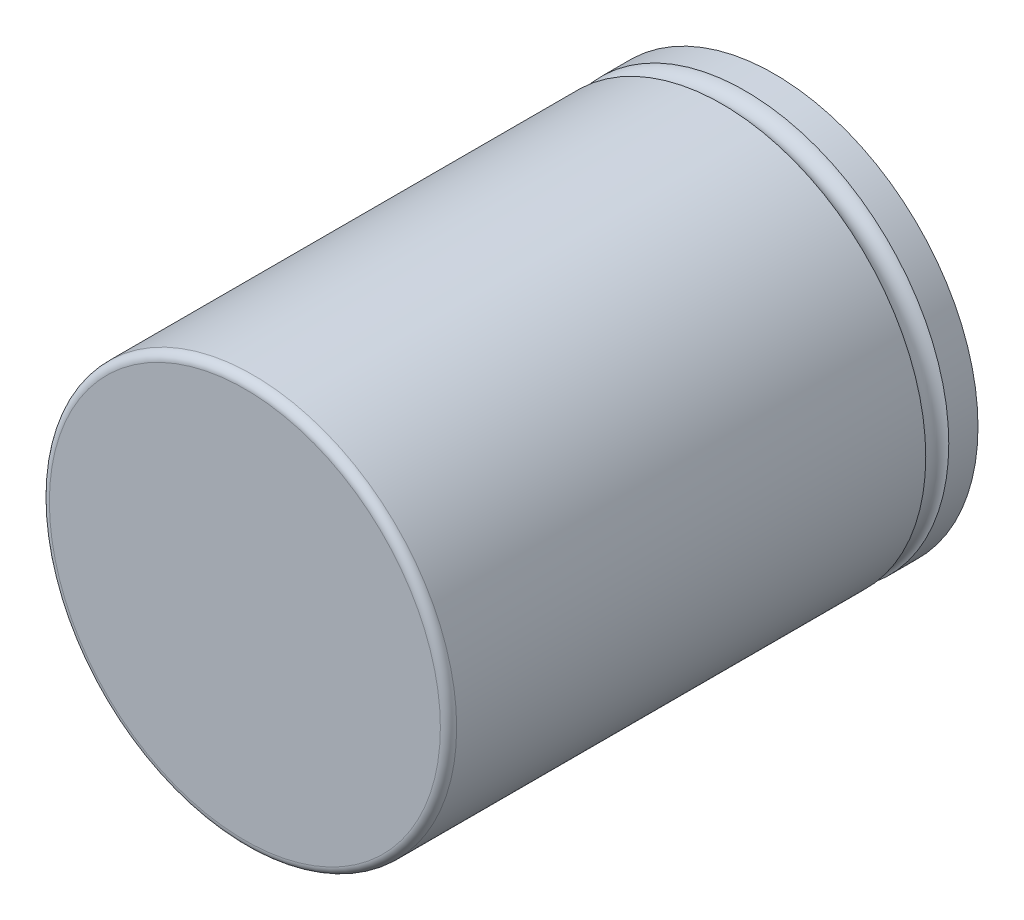
ISO-10303-21;
HEADER;
FILE_DESCRIPTION(('STEP AP214'),'2;1');
FILE_NAME('part.step','',(''),(''),'','','');
FILE_SCHEMA(('AUTOMOTIVE_DESIGN { 1 0 10303 214 1 1 1 1 }'));
ENDSEC;
DATA;
#1=APPLICATION_CONTEXT('core data for automotive mechanical design processes');
#2=APPLICATION_PROTOCOL_DEFINITION('international standard','automotive_design',2000,#1);
#3=PRODUCT_CONTEXT('',#1,'mechanical');
#4=PRODUCT('Part','Part','',(#3));
#5=PRODUCT_RELATED_PRODUCT_CATEGORY('part','',(#4));
#6=PRODUCT_DEFINITION_FORMATION('','',#4);
#7=PRODUCT_DEFINITION_CONTEXT('part definition',#1,'design');
#8=PRODUCT_DEFINITION('design','',#6,#7);
#9=PRODUCT_DEFINITION_SHAPE('','',#8);
#10=(LENGTH_UNIT() NAMED_UNIT(*) SI_UNIT(.MILLI.,.METRE.));
#11=(NAMED_UNIT(*) PLANE_ANGLE_UNIT() SI_UNIT($,.RADIAN.));
#12=(NAMED_UNIT(*) SI_UNIT($,.STERADIAN.) SOLID_ANGLE_UNIT());
#13=UNCERTAINTY_MEASURE_WITH_UNIT(LENGTH_MEASURE(1.E-05),#10,'distance_accuracy_value','');
#14=(GEOMETRIC_REPRESENTATION_CONTEXT(3) GLOBAL_UNCERTAINTY_ASSIGNED_CONTEXT((#13)) GLOBAL_UNIT_ASSIGNED_CONTEXT((#10,
#11,#12)) REPRESENTATION_CONTEXT('',''));
#15=CARTESIAN_POINT('',(0.,0.,0.));
#16=DIRECTION('',(0.,0.,1.));
#17=DIRECTION('',(1.,0.,0.));
#18=AXIS2_PLACEMENT_3D('',#15,#16,#17);
#19=CARTESIAN_POINT('',(0.,2.5,1.));
#20=DIRECTION('',(0.,0.,1.));
#21=DIRECTION('',(1.,0.,0.));
#22=AXIS2_PLACEMENT_3D('',#19,#20,#21);
#23=PLANE('',#22);
#24=CARTESIAN_POINT('',(0.,2.5,1.));
#25=DIRECTION('',(0.,0.,-1.));
#26=DIRECTION('',(-1.,0.,0.));
#27=AXIS2_PLACEMENT_3D('',#24,#25,#26);
#28=CIRCLE('',#27,0.3);
#29=CARTESIAN_POINT('',(-0.3,2.5,1.));
#30=VERTEX_POINT('',#29);
#31=EDGE_CURVE('E18',#30,#30,#28,.T.);
#32=ORIENTED_EDGE('',*,*,#31,.T.);
#33=EDGE_LOOP('',(#32));
#34=FACE_BOUND('',#33,.T.);
#35=ADVANCED_FACE('F15',(#34),#23,.F.);
#36=CARTESIAN_POINT('',(0.,-2.5,1.));
#37=DIRECTION('',(0.,0.,1.));
#38=DIRECTION('',(1.,0.,0.));
#39=AXIS2_PLACEMENT_3D('',#36,#37,#38);
#40=PLANE('',#39);
#41=CARTESIAN_POINT('',(0.,-2.5,1.));
#42=DIRECTION('',(0.,0.,-1.));
#43=DIRECTION('',(-1.,0.,0.));
#44=AXIS2_PLACEMENT_3D('',#41,#42,#43);
#45=CIRCLE('',#44,0.3);
#46=CARTESIAN_POINT('',(-0.3,-2.5,1.));
#47=VERTEX_POINT('',#46);
#48=EDGE_CURVE('E67',#47,#47,#45,.T.);
#49=ORIENTED_EDGE('',*,*,#48,.T.);
#50=EDGE_LOOP('',(#49));
#51=FACE_BOUND('',#50,.T.);
#52=ADVANCED_FACE('F79',(#51),#40,.F.);
#53=CARTESIAN_POINT('',(0.,2.5,0.));
#54=DIRECTION('',(0.,0.,-1.));
#55=DIRECTION('',(-1.,0.,0.));
#56=AXIS2_PLACEMENT_3D('',#53,#54,#55);
#57=CYLINDRICAL_SURFACE('',#56,0.3);
#58=ORIENTED_EDGE('',*,*,#31,.F.);
#59=EDGE_LOOP('',(#58));
#60=FACE_BOUND('',#59,.T.);
#61=CARTESIAN_POINT('',(0.,2.5,0.));
#62=DIRECTION('',(0.,0.,-1.));
#63=DIRECTION('',(-1.,0.,0.));
#64=AXIS2_PLACEMENT_3D('',#61,#62,#63);
#65=CIRCLE('',#64,0.3);
#66=CARTESIAN_POINT('',(-0.3,2.5,0.));
#67=VERTEX_POINT('',#66);
#68=EDGE_CURVE('E65',#67,#67,#65,.F.);
#69=ORIENTED_EDGE('',*,*,#68,.F.);
#70=EDGE_LOOP('',(#69));
#71=FACE_BOUND('',#70,.T.);
#72=ADVANCED_FACE('F75',(#60,#71),#57,.F.);
#73=CARTESIAN_POINT('',(0.,-2.5,0.));
#74=DIRECTION('',(0.,0.,-1.));
#75=DIRECTION('',(-1.,0.,0.));
#76=AXIS2_PLACEMENT_3D('',#73,#74,#75);
#77=CYLINDRICAL_SURFACE('',#76,0.3);
#78=ORIENTED_EDGE('',*,*,#48,.F.);
#79=EDGE_LOOP('',(#78));
#80=FACE_BOUND('',#79,.T.);
#81=CARTESIAN_POINT('',(0.,-2.5,0.));
#82=DIRECTION('',(0.,0.,-1.));
#83=DIRECTION('',(-1.,0.,0.));
#84=AXIS2_PLACEMENT_3D('',#81,#82,#83);
#85=CIRCLE('',#84,0.3);
#86=CARTESIAN_POINT('',(-0.3,-2.5,0.));
#87=VERTEX_POINT('',#86);
#88=EDGE_CURVE('E62',#87,#87,#85,.F.);
#89=ORIENTED_EDGE('',*,*,#88,.F.);
#90=EDGE_LOOP('',(#89));
#91=FACE_BOUND('',#90,.T.);
#92=ADVANCED_FACE('F78',(#80,#91),#77,.F.);
#93=CARTESIAN_POINT('',(0.,0.,0.));
#94=DIRECTION('',(0.,0.,-1.));
#95=DIRECTION('',(-1.,0.,0.));
#96=AXIS2_PLACEMENT_3D('',#93,#94,#95);
#97=PLANE('',#96);
#98=ORIENTED_EDGE('',*,*,#88,.T.);
#99=EDGE_LOOP('',(#98));
#100=FACE_BOUND('',#99,.T.);
#101=ORIENTED_EDGE('',*,*,#68,.T.);
#102=EDGE_LOOP('',(#101));
#103=FACE_BOUND('',#102,.T.);
#104=CARTESIAN_POINT('',(0.,0.,0.));
#105=DIRECTION('',(0.,0.,-1.));
#106=DIRECTION('',(-1.,0.,0.));
#107=AXIS2_PLACEMENT_3D('',#104,#105,#106);
#108=CIRCLE('',#107,5.);
#109=CARTESIAN_POINT('',(-5.,0.,0.));
#110=VERTEX_POINT('',#109);
#111=EDGE_CURVE('E59',#110,#110,#108,.F.);
#112=ORIENTED_EDGE('',*,*,#111,.F.);
#113=EDGE_LOOP('',(#112));
#114=FACE_BOUND('',#113,.T.);
#115=ADVANCED_FACE('F83',(#100,#103,#114),#97,.T.);
#116=CARTESIAN_POINT('',(0.,0.,0.));
#117=DIRECTION('',(0.,0.,-1.));
#118=DIRECTION('',(-1.,0.,0.));
#119=AXIS2_PLACEMENT_3D('',#116,#117,#118);
#120=CYLINDRICAL_SURFACE('',#119,5.);
#121=ORIENTED_EDGE('',*,*,#111,.T.);
#122=EDGE_LOOP('',(#121));
#123=FACE_BOUND('',#122,.T.);
#124=CARTESIAN_POINT('',(0.,0.,0.717157287525381));
#125=DIRECTION('',(0.,0.,-1.));
#126=DIRECTION('',(-1.,0.,0.));
#127=AXIS2_PLACEMENT_3D('',#124,#125,#126);
#128=CIRCLE('',#127,5.);
#129=CARTESIAN_POINT('',(-5.,0.,0.717157287525381));
#130=VERTEX_POINT('',#129);
#131=EDGE_CURVE('E51',#130,#130,#128,.T.);
#132=ORIENTED_EDGE('',*,*,#131,.T.);
#133=EDGE_LOOP('',(#132));
#134=FACE_BOUND('',#133,.T.);
#135=ADVANCED_FACE('F86',(#123,#134),#120,.T.);
#136=CARTESIAN_POINT('',(0.,0.,13.));
#137=DIRECTION('',(0.,0.,-1.));
#138=DIRECTION('',(-1.,0.,0.));
#139=AXIS2_PLACEMENT_3D('',#136,#137,#138);
#140=PLANE('',#139);
#141=CARTESIAN_POINT('',(0.,0.,13.));
#142=DIRECTION('',(0.,0.,-1.));
#143=DIRECTION('',(1.,0.,0.));
#144=AXIS2_PLACEMENT_3D('',#141,#142,#143);
#145=CIRCLE('',#144,4.8);
#146=CARTESIAN_POINT('',(4.8,0.,13.));
#147=VERTEX_POINT('',#146);
#148=EDGE_CURVE('E27',#147,#147,#145,.T.);
#149=ORIENTED_EDGE('',*,*,#148,.F.);
#150=EDGE_LOOP('',(#149));
#151=FACE_BOUND('',#150,.T.);
#152=ADVANCED_FACE('F93',(#151),#140,.F.);
#153=CARTESIAN_POINT('',(0.,0.,1.));
#154=DIRECTION('',(0.,0.,-1.));
#155=DIRECTION('',(-1.,0.,0.));
#156=AXIS2_PLACEMENT_3D('',#153,#154,#155);
#157=TOROIDAL_SURFACE('',#156,5.1,0.3);
#158=CARTESIAN_POINT('',(0.,0.,1.28284271247462));
#159=DIRECTION('',(0.,0.,-1.));
#160=DIRECTION('',(-1.,0.,0.));
#161=AXIS2_PLACEMENT_3D('',#158,#159,#160);
#162=CIRCLE('',#161,5.);
#163=CARTESIAN_POINT('',(-5.,0.,1.28284271247462));
#164=VERTEX_POINT('',#163);
#165=EDGE_CURVE('E22',#164,#164,#162,.F.);
#166=ORIENTED_EDGE('',*,*,#165,.F.);
#167=EDGE_LOOP('',(#166));
#168=FACE_BOUND('',#167,.T.);
#169=ORIENTED_EDGE('',*,*,#131,.F.);
#170=EDGE_LOOP('',(#169));
#171=FACE_BOUND('',#170,.T.);
#172=ADVANCED_FACE('F41',(#168,#171),#157,.F.);
#173=CARTESIAN_POINT('',(0.,0.,12.8));
#174=DIRECTION('',(0.,0.,-1.));
#175=DIRECTION('',(-1.,0.,0.));
#176=AXIS2_PLACEMENT_3D('',#173,#174,#175);
#177=TOROIDAL_SURFACE('',#176,4.8,0.2);
#178=CARTESIAN_POINT('',(0.,0.,12.8));
#179=DIRECTION('',(0.,0.,-1.));
#180=DIRECTION('',(-1.,0.,0.));
#181=AXIS2_PLACEMENT_3D('',#178,#179,#180);
#182=CIRCLE('',#181,5.);
#183=CARTESIAN_POINT('',(-5.,0.,12.8));
#184=VERTEX_POINT('',#183);
#185=EDGE_CURVE('E10',#184,#184,#182,.T.);
#186=ORIENTED_EDGE('',*,*,#185,.F.);
#187=EDGE_LOOP('',(#186));
#188=FACE_BOUND('',#187,.T.);
#189=ORIENTED_EDGE('',*,*,#148,.T.);
#190=EDGE_LOOP('',(#189));
#191=FACE_BOUND('',#190,.T.);
#192=ADVANCED_FACE('F35',(#188,#191),#177,.T.);
#193=CARTESIAN_POINT('',(0.,0.,0.));
#194=DIRECTION('',(0.,0.,-1.));
#195=DIRECTION('',(-1.,0.,0.));
#196=AXIS2_PLACEMENT_3D('',#193,#194,#195);
#197=CYLINDRICAL_SURFACE('',#196,5.);
#198=ORIENTED_EDGE('',*,*,#165,.T.);
#199=EDGE_LOOP('',(#198));
#200=FACE_BOUND('',#199,.T.);
#201=ORIENTED_EDGE('',*,*,#185,.T.);
#202=EDGE_LOOP('',(#201));
#203=FACE_BOUND('',#202,.T.);
#204=ADVANCED_FACE('F40',(#200,#203),#197,.T.);
#205=CLOSED_SHELL('',(#35,#52,#72,#92,#115,#135,#152,#172,#192,#204));
#206=MANIFOLD_SOLID_BREP('B1',#205);
#207=ADVANCED_BREP_SHAPE_REPRESENTATION('',(#18,#206),#14);
#208=SHAPE_DEFINITION_REPRESENTATION(#9,#207);
ENDSEC;
END-ISO-10303-21;
